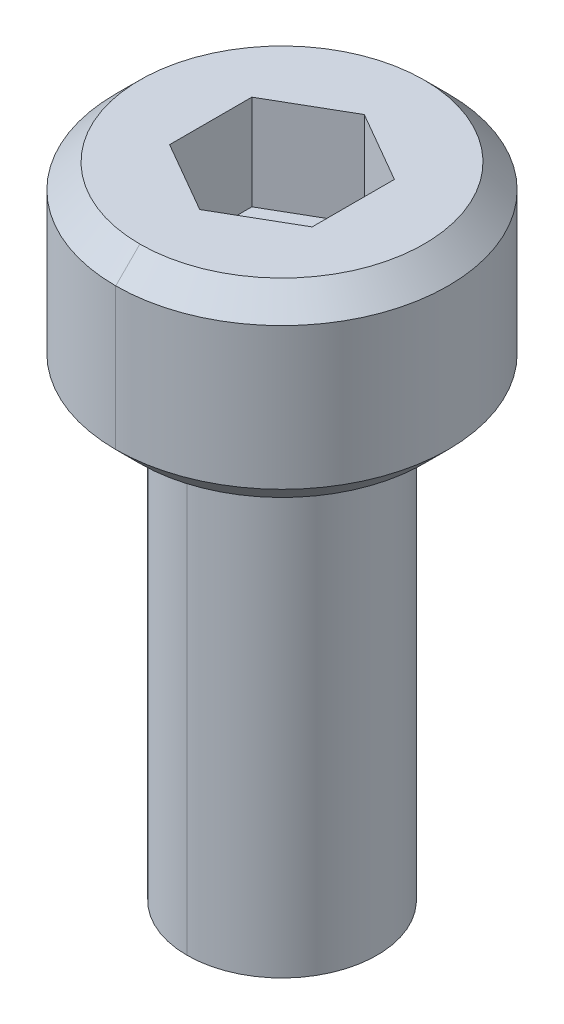
ISO-10303-21;
HEADER;
FILE_DESCRIPTION(('STEP AP214'),'2;1');
FILE_NAME('part.step','',(''),(''),'','','');
FILE_SCHEMA(('AUTOMOTIVE_DESIGN { 1 0 10303 214 1 1 1 1 }'));
ENDSEC;
DATA;
#1=APPLICATION_CONTEXT('core data for automotive mechanical design processes');
#2=APPLICATION_PROTOCOL_DEFINITION('international standard','automotive_design',2000,#1);
#3=PRODUCT_CONTEXT('',#1,'mechanical');
#4=PRODUCT('Part','Part','',(#3));
#5=PRODUCT_RELATED_PRODUCT_CATEGORY('part','',(#4));
#6=PRODUCT_DEFINITION_FORMATION('','',#4);
#7=PRODUCT_DEFINITION_CONTEXT('part definition',#1,'design');
#8=PRODUCT_DEFINITION('design','',#6,#7);
#9=PRODUCT_DEFINITION_SHAPE('','',#8);
#10=(LENGTH_UNIT() NAMED_UNIT(*) SI_UNIT(.MILLI.,.METRE.));
#11=(NAMED_UNIT(*) PLANE_ANGLE_UNIT() SI_UNIT($,.RADIAN.));
#12=(NAMED_UNIT(*) SI_UNIT($,.STERADIAN.) SOLID_ANGLE_UNIT());
#13=UNCERTAINTY_MEASURE_WITH_UNIT(LENGTH_MEASURE(1.E-05),#10,'distance_accuracy_value','');
#14=(GEOMETRIC_REPRESENTATION_CONTEXT(3) GLOBAL_UNCERTAINTY_ASSIGNED_CONTEXT((#13)) GLOBAL_UNIT_ASSIGNED_CONTEXT((#10,
#11,#12)) REPRESENTATION_CONTEXT('',''));
#15=CARTESIAN_POINT('',(0.,0.,0.));
#16=DIRECTION('',(0.,0.,1.));
#17=DIRECTION('',(1.,0.,0.));
#18=AXIS2_PLACEMENT_3D('',#15,#16,#17);
#19=CARTESIAN_POINT('',(0.,-9.46152,0.));
#20=DIRECTION('',(0.,1.,0.));
#21=DIRECTION('',(0.,0.,1.));
#22=AXIS2_PLACEMENT_3D('',#19,#20,#21);
#23=CONICAL_SURFACE('',#22,2.,0.960291895410487);
#24=DIRECTION('',(0.,0.573280843383964,-0.819358941251617));
#25=VECTOR('',#24,1.);
#26=CARTESIAN_POINT('',(0.,-9.46152,-2.));
#27=LINE('',#26,#25);
#28=CARTESIAN_POINT('',(0.,-10.,-1.23038));
#29=VERTEX_POINT('',#28);
#30=CARTESIAN_POINT('',(0.,-9.46152,-2.));
#31=VERTEX_POINT('',#30);
#32=EDGE_CURVE('E162',#29,#31,#27,.T.);
#33=ORIENTED_EDGE('',*,*,#32,.F.);
#34=CARTESIAN_POINT('',(0.,-10.,0.));
#35=DIRECTION('',(0.,-1.,0.));
#36=DIRECTION('',(0.,0.,1.));
#37=AXIS2_PLACEMENT_3D('',#34,#35,#36);
#38=CIRCLE('',#37,1.23038);
#39=CARTESIAN_POINT('',(0.,-10.,1.23037999999998));
#40=VERTEX_POINT('',#39);
#41=EDGE_CURVE('E151',#40,#29,#38,.T.);
#42=ORIENTED_EDGE('',*,*,#41,.F.);
#43=DIRECTION('',(0.,0.573280843383964,0.819358941251617));
#44=VECTOR('',#43,1.);
#45=CARTESIAN_POINT('',(0.,-9.46152,2.));
#46=LINE('',#45,#44);
#47=CARTESIAN_POINT('',(0.,-9.46152,2.));
#48=VERTEX_POINT('',#47);
#49=EDGE_CURVE('E159',#40,#48,#46,.T.);
#50=ORIENTED_EDGE('',*,*,#49,.T.);
#51=CARTESIAN_POINT('',(0.,-9.46152,0.));
#52=DIRECTION('',(0.,1.,0.));
#53=DIRECTION('',(0.,0.,1.));
#54=AXIS2_PLACEMENT_3D('',#51,#52,#53);
#55=CIRCLE('',#54,2.);
#56=EDGE_CURVE('E207',#31,#48,#55,.T.);
#57=ORIENTED_EDGE('',*,*,#56,.F.);
#58=EDGE_LOOP('',(#33,#42,#50,#57));
#59=FACE_BOUND('',#58,.T.);
#60=ADVANCED_FACE('F16',(#59),#23,.T.);
#61=CARTESIAN_POINT('',(0.,0.508,0.));
#62=DIRECTION('',(0.,1.,0.));
#63=DIRECTION('',(0.,0.,1.));
#64=AXIS2_PLACEMENT_3D('',#61,#62,#63);
#65=CONICAL_SURFACE('',#64,3.5,0.78539816339745);
#66=DIRECTION('',(0.,0.707106781186547,-0.707106781186549));
#67=VECTOR('',#66,1.);
#68=CARTESIAN_POINT('',(0.,0.508,-3.5));
#69=LINE('',#68,#67);
#70=CARTESIAN_POINT('',(0.,0.,-2.992));
#71=VERTEX_POINT('',#70);
#72=CARTESIAN_POINT('',(0.,0.508,-3.5));
#73=VERTEX_POINT('',#72);
#74=EDGE_CURVE('E264',#71,#73,#69,.T.);
#75=ORIENTED_EDGE('',*,*,#74,.F.);
#76=CARTESIAN_POINT('',(0.,0.,0.));
#77=DIRECTION('',(0.,-1.,0.));
#78=DIRECTION('',(0.,0.,1.));
#79=AXIS2_PLACEMENT_3D('',#76,#77,#78);
#80=CIRCLE('',#79,2.992);
#81=CARTESIAN_POINT('',(0.,0.,2.992));
#82=VERTEX_POINT('',#81);
#83=EDGE_CURVE('E211',#82,#71,#80,.T.);
#84=ORIENTED_EDGE('',*,*,#83,.F.);
#85=DIRECTION('',(0.,0.707106781186547,0.707106781186549));
#86=VECTOR('',#85,1.);
#87=CARTESIAN_POINT('',(0.,0.508,3.5));
#88=LINE('',#87,#86);
#89=CARTESIAN_POINT('',(0.,0.508,3.5));
#90=VERTEX_POINT('',#89);
#91=EDGE_CURVE('E229',#82,#90,#88,.T.);
#92=ORIENTED_EDGE('',*,*,#91,.T.);
#93=CARTESIAN_POINT('',(0.,0.508,0.));
#94=DIRECTION('',(0.,1.,0.));
#95=DIRECTION('',(0.,0.,1.));
#96=AXIS2_PLACEMENT_3D('',#93,#94,#95);
#97=CIRCLE('',#96,3.5);
#98=EDGE_CURVE('E140',#73,#90,#97,.T.);
#99=ORIENTED_EDGE('',*,*,#98,.F.);
#100=EDGE_LOOP('',(#75,#84,#92,#99));
#101=FACE_BOUND('',#100,.T.);
#102=ADVANCED_FACE('F320',(#101),#65,.T.);
#103=CARTESIAN_POINT('',(0.,3.999992,0.));
#104=DIRECTION('',(0.,-1.,0.));
#105=DIRECTION('',(0.,0.,-1.));
#106=AXIS2_PLACEMENT_3D('',#103,#104,#105);
#107=CONICAL_SURFACE('',#106,2.992,0.785398163397445);
#108=DIRECTION('',(0.,-0.70710678118655,0.707106781186545));
#109=VECTOR('',#108,1.);
#110=CARTESIAN_POINT('',(0.,3.999992,2.992));
#111=LINE('',#110,#109);
#112=CARTESIAN_POINT('',(0.,3.999992,2.992));
#113=VERTEX_POINT('',#112);
#114=CARTESIAN_POINT('',(0.,3.491992,3.5));
#115=VERTEX_POINT('',#114);
#116=EDGE_CURVE('E199',#113,#115,#111,.T.);
#117=ORIENTED_EDGE('',*,*,#116,.F.);
#118=CARTESIAN_POINT('',(0.,3.999992,0.));
#119=DIRECTION('',(0.,1.,0.));
#120=DIRECTION('',(0.,0.,1.));
#121=AXIS2_PLACEMENT_3D('',#118,#119,#120);
#122=CIRCLE('',#121,2.992);
#123=CARTESIAN_POINT('',(0.,3.999992,-2.992));
#124=VERTEX_POINT('',#123);
#125=EDGE_CURVE('E130',#124,#113,#122,.T.);
#126=ORIENTED_EDGE('',*,*,#125,.F.);
#127=DIRECTION('',(0.,-0.70710678118655,-0.707106781186545));
#128=VECTOR('',#127,1.);
#129=CARTESIAN_POINT('',(0.,3.999992,-2.992));
#130=LINE('',#129,#128);
#131=CARTESIAN_POINT('',(0.,3.491992,-3.5));
#132=VERTEX_POINT('',#131);
#133=EDGE_CURVE('E237',#124,#132,#130,.T.);
#134=ORIENTED_EDGE('',*,*,#133,.T.);
#135=CARTESIAN_POINT('',(0.,3.491992,0.));
#136=DIRECTION('',(0.,-1.,0.));
#137=DIRECTION('',(0.,0.,1.));
#138=AXIS2_PLACEMENT_3D('',#135,#136,#137);
#139=CIRCLE('',#138,3.5);
#140=EDGE_CURVE('E165',#115,#132,#139,.T.);
#141=ORIENTED_EDGE('',*,*,#140,.F.);
#142=EDGE_LOOP('',(#117,#126,#134,#141));
#143=FACE_BOUND('',#142,.T.);
#144=ADVANCED_FACE('F548',(#143),#107,.T.);
#145=CARTESIAN_POINT('',(1.5,1.999992,2.5980762113533));
#146=DIRECTION('',(0.,1.,0.));
#147=DIRECTION('',(0.,0.,-1.));
#148=AXIS2_PLACEMENT_3D('',#145,#146,#147);
#149=PLANE('',#148);
#150=DIRECTION('',(0.866025403784439,0.,0.5));
#151=VECTOR('',#150,1.);
#152=CARTESIAN_POINT('',(-1.5,1.999992,0.866025403784439));
#153=LINE('',#152,#151);
#154=CARTESIAN_POINT('',(-1.5,1.999992,0.866025403784439));
#155=VERTEX_POINT('',#154);
#156=CARTESIAN_POINT('',(0.,1.999992,1.73205080756887));
#157=VERTEX_POINT('',#156);
#158=EDGE_CURVE('E226',#155,#157,#153,.T.);
#159=ORIENTED_EDGE('',*,*,#158,.T.);
#160=DIRECTION('',(0.866025403784439,0.,-0.5));
#161=VECTOR('',#160,1.);
#162=CARTESIAN_POINT('',(0.,1.999992,1.73205080756887));
#163=LINE('',#162,#161);
#164=CARTESIAN_POINT('',(1.5,1.999992,0.866025403784439));
#165=VERTEX_POINT('',#164);
#166=EDGE_CURVE('E11',#157,#165,#163,.T.);
#167=ORIENTED_EDGE('',*,*,#166,.T.);
#168=DIRECTION('',(0.,0.,-1.));
#169=VECTOR('',#168,1.);
#170=CARTESIAN_POINT('',(1.5,1.999992,0.866025403784439));
#171=LINE('',#170,#169);
#172=CARTESIAN_POINT('',(1.5,1.99999200000004,-0.866025403784422));
#173=VERTEX_POINT('',#172);
#174=EDGE_CURVE('E195',#165,#173,#171,.T.);
#175=ORIENTED_EDGE('',*,*,#174,.T.);
#176=DIRECTION('',(-0.866025403784439,0.,-0.5));
#177=VECTOR('',#176,1.);
#178=CARTESIAN_POINT('',(1.5,1.99999200000004,-0.866025403784422));
#179=LINE('',#178,#177);
#180=CARTESIAN_POINT('',(0.,1.999992,-1.73205080756887));
#181=VERTEX_POINT('',#180);
#182=EDGE_CURVE('E221',#173,#181,#179,.T.);
#183=ORIENTED_EDGE('',*,*,#182,.T.);
#184=DIRECTION('',(-0.866025403784439,0.,0.5));
#185=VECTOR('',#184,1.);
#186=CARTESIAN_POINT('',(0.,1.999992,-1.73205080756887));
#187=LINE('',#186,#185);
#188=CARTESIAN_POINT('',(-1.5,1.999992,-0.866025403784432));
#189=VERTEX_POINT('',#188);
#190=EDGE_CURVE('E184',#181,#189,#187,.T.);
#191=ORIENTED_EDGE('',*,*,#190,.T.);
#192=DIRECTION('',(0.,0.,1.));
#193=VECTOR('',#192,1.);
#194=CARTESIAN_POINT('',(-1.5,1.999992,-0.866025403784432));
#195=LINE('',#194,#193);
#196=EDGE_CURVE('E257',#189,#155,#195,.T.);
#197=ORIENTED_EDGE('',*,*,#196,.T.);
#198=EDGE_LOOP('',(#159,#167,#175,#183,#191,#197));
#199=FACE_BOUND('',#198,.T.);
#200=ADVANCED_FACE('F543',(#199),#149,.T.);
#201=CARTESIAN_POINT('',(0.,1.999992,1.73205080756887));
#202=DIRECTION('',(0.5,0.,0.866025403784439));
#203=DIRECTION('',(0.,-1.,0.));
#204=AXIS2_PLACEMENT_3D('',#201,#202,#203);
#205=PLANE('',#204);
#206=DIRECTION('',(0.866025403784439,0.,-0.5));
#207=VECTOR('',#206,1.);
#208=CARTESIAN_POINT('',(0.,3.999992,1.73205080756889));
#209=LINE('',#208,#207);
#210=CARTESIAN_POINT('',(0.,3.999992,1.73205080756889));
#211=VERTEX_POINT('',#210);
#212=CARTESIAN_POINT('',(1.5,3.999992,0.866025403784439));
#213=VERTEX_POINT('',#212);
#214=EDGE_CURVE('E215',#211,#213,#209,.T.);
#215=ORIENTED_EDGE('',*,*,#214,.T.);
#216=DIRECTION('',(0.,1.,0.));
#217=VECTOR('',#216,1.);
#218=CARTESIAN_POINT('',(1.5,1.999992,0.866025403784439));
#219=LINE('',#218,#217);
#220=EDGE_CURVE('E27',#165,#213,#219,.T.);
#221=ORIENTED_EDGE('',*,*,#220,.F.);
#222=ORIENTED_EDGE('',*,*,#166,.F.);
#223=DIRECTION('',(0.,1.,0.));
#224=VECTOR('',#223,1.);
#225=CARTESIAN_POINT('',(0.,1.999992,1.73205080756887));
#226=LINE('',#225,#224);
#227=EDGE_CURVE('E214',#157,#211,#226,.T.);
#228=ORIENTED_EDGE('',*,*,#227,.T.);
#229=EDGE_LOOP('',(#215,#221,#222,#228));
#230=FACE_BOUND('',#229,.T.);
#231=ADVANCED_FACE('F547',(#230),#205,.F.);
#232=CARTESIAN_POINT('',(1.5,1.999992,0.866025403784439));
#233=DIRECTION('',(1.,0.,0.));
#234=DIRECTION('',(0.,-1.,0.));
#235=AXIS2_PLACEMENT_3D('',#232,#233,#234);
#236=PLANE('',#235);
#237=DIRECTION('',(0.,0.,-1.));
#238=VECTOR('',#237,1.);
#239=CARTESIAN_POINT('',(1.5,3.999992,0.866025403784439));
#240=LINE('',#239,#238);
#241=CARTESIAN_POINT('',(1.5,3.999992,-0.866025403784429));
#242=VERTEX_POINT('',#241);
#243=EDGE_CURVE('E216',#213,#242,#240,.T.);
#244=ORIENTED_EDGE('',*,*,#243,.T.);
#245=DIRECTION('',(0.,1.,0.));
#246=VECTOR('',#245,1.);
#247=CARTESIAN_POINT('',(1.5,1.99999200000004,-0.866025403784422));
#248=LINE('',#247,#246);
#249=EDGE_CURVE('E198',#173,#242,#248,.T.);
#250=ORIENTED_EDGE('',*,*,#249,.F.);
#251=ORIENTED_EDGE('',*,*,#174,.F.);
#252=ORIENTED_EDGE('',*,*,#220,.T.);
#253=EDGE_LOOP('',(#244,#250,#251,#252));
#254=FACE_BOUND('',#253,.T.);
#255=ADVANCED_FACE('F572',(#254),#236,.F.);
#256=CARTESIAN_POINT('',(1.5,1.99999200000004,-0.866025403784422));
#257=DIRECTION('',(0.5,0.,-0.866025403784439));
#258=DIRECTION('',(0.,-1.,0.));
#259=AXIS2_PLACEMENT_3D('',#256,#257,#258);
#260=PLANE('',#259);
#261=DIRECTION('',(-0.866025403784439,0.,-0.5));
#262=VECTOR('',#261,1.);
#263=CARTESIAN_POINT('',(1.5,3.999992,-0.866025403784429));
#264=LINE('',#263,#262);
#265=CARTESIAN_POINT('',(0.,3.99999200000005,-1.73205080756887));
#266=VERTEX_POINT('',#265);
#267=EDGE_CURVE('E220',#242,#266,#264,.T.);
#268=ORIENTED_EDGE('',*,*,#267,.T.);
#269=DIRECTION('',(0.,1.,0.));
#270=VECTOR('',#269,1.);
#271=CARTESIAN_POINT('',(0.,1.999992,-1.73205080756887));
#272=LINE('',#271,#270);
#273=EDGE_CURVE('E187',#181,#266,#272,.T.);
#274=ORIENTED_EDGE('',*,*,#273,.F.);
#275=ORIENTED_EDGE('',*,*,#182,.F.);
#276=ORIENTED_EDGE('',*,*,#249,.T.);
#277=EDGE_LOOP('',(#268,#274,#275,#276));
#278=FACE_BOUND('',#277,.T.);
#279=ADVANCED_FACE('F616',(#278),#260,.F.);
#280=CARTESIAN_POINT('',(0.,1.999992,-1.73205080756887));
#281=DIRECTION('',(-0.5,0.,-0.866025403784439));
#282=DIRECTION('',(-0.866025403784439,0.,0.5));
#283=AXIS2_PLACEMENT_3D('',#280,#281,#282);
#284=PLANE('',#283);
#285=DIRECTION('',(-0.866025403784439,0.,0.5));
#286=VECTOR('',#285,1.);
#287=CARTESIAN_POINT('',(0.,3.99999200000005,-1.73205080756887));
#288=LINE('',#287,#286);
#289=CARTESIAN_POINT('',(-1.5,3.999992,-0.866025403784432));
#290=VERTEX_POINT('',#289);
#291=EDGE_CURVE('E193',#266,#290,#288,.T.);
#292=ORIENTED_EDGE('',*,*,#291,.T.);
#293=DIRECTION('',(0.,1.,0.));
#294=VECTOR('',#293,1.);
#295=CARTESIAN_POINT('',(-1.5,1.999992,-0.866025403784432));
#296=LINE('',#295,#294);
#297=EDGE_CURVE('E188',#189,#290,#296,.T.);
#298=ORIENTED_EDGE('',*,*,#297,.F.);
#299=ORIENTED_EDGE('',*,*,#190,.F.);
#300=ORIENTED_EDGE('',*,*,#273,.T.);
#301=EDGE_LOOP('',(#292,#298,#299,#300));
#302=FACE_BOUND('',#301,.T.);
#303=ADVANCED_FACE('F18',(#302),#284,.F.);
#304=CARTESIAN_POINT('',(-1.5,1.999992,-0.866025403784432));
#305=DIRECTION('',(-1.,0.,0.));
#306=DIRECTION('',(0.,0.,1.));
#307=AXIS2_PLACEMENT_3D('',#304,#305,#306);
#308=PLANE('',#307);
#309=DIRECTION('',(0.,0.,1.));
#310=VECTOR('',#309,1.);
#311=CARTESIAN_POINT('',(-1.5,3.999992,-0.866025403784432));
#312=LINE('',#311,#310);
#313=CARTESIAN_POINT('',(-1.5,3.999992,0.866025403784453));
#314=VERTEX_POINT('',#313);
#315=EDGE_CURVE('E189',#290,#314,#312,.T.);
#316=ORIENTED_EDGE('',*,*,#315,.T.);
#317=DIRECTION('',(0.,1.,0.));
#318=VECTOR('',#317,1.);
#319=CARTESIAN_POINT('',(-1.5,1.999992,0.866025403784439));
#320=LINE('',#319,#318);
#321=EDGE_CURVE('E260',#155,#314,#320,.T.);
#322=ORIENTED_EDGE('',*,*,#321,.F.);
#323=ORIENTED_EDGE('',*,*,#196,.F.);
#324=ORIENTED_EDGE('',*,*,#297,.T.);
#325=EDGE_LOOP('',(#316,#322,#323,#324));
#326=FACE_BOUND('',#325,.T.);
#327=ADVANCED_FACE('F581',(#326),#308,.F.);
#328=CARTESIAN_POINT('',(-1.5,1.999992,0.866025403784439));
#329=DIRECTION('',(-0.5,0.,0.866025403784439));
#330=DIRECTION('',(0.,1.,0.));
#331=AXIS2_PLACEMENT_3D('',#328,#329,#330);
#332=PLANE('',#331);
#333=DIRECTION('',(0.866025403784439,0.,0.5));
#334=VECTOR('',#333,1.);
#335=CARTESIAN_POINT('',(-1.5,3.999992,0.866025403784453));
#336=LINE('',#335,#334);
#337=EDGE_CURVE('E194',#314,#211,#336,.T.);
#338=ORIENTED_EDGE('',*,*,#337,.T.);
#339=ORIENTED_EDGE('',*,*,#227,.F.);
#340=ORIENTED_EDGE('',*,*,#158,.F.);
#341=ORIENTED_EDGE('',*,*,#321,.T.);
#342=EDGE_LOOP('',(#338,#339,#340,#341));
#343=FACE_BOUND('',#342,.T.);
#344=ADVANCED_FACE('F314',(#343),#332,.F.);
#345=CARTESIAN_POINT('',(0.,0.,0.));
#346=DIRECTION('',(0.,1.,0.));
#347=DIRECTION('',(0.,0.,-1.));
#348=AXIS2_PLACEMENT_3D('',#345,#346,#347);
#349=PLANE('',#348);
#350=CARTESIAN_POINT('',(0.,0.,0.));
#351=DIRECTION('',(0.,1.,0.));
#352=DIRECTION('',(0.,0.,1.));
#353=AXIS2_PLACEMENT_3D('',#350,#351,#352);
#354=CIRCLE('',#353,2.);
#355=CARTESIAN_POINT('',(0.,0.,2.));
#356=VERTEX_POINT('',#355);
#357=CARTESIAN_POINT('',(0.,0.,-2.));
#358=VERTEX_POINT('',#357);
#359=EDGE_CURVE('E238',#356,#358,#354,.T.);
#360=ORIENTED_EDGE('',*,*,#359,.T.);
#361=CARTESIAN_POINT('',(0.,0.,0.));
#362=DIRECTION('',(0.,1.,0.));
#363=DIRECTION('',(0.,0.,1.));
#364=AXIS2_PLACEMENT_3D('',#361,#362,#363);
#365=CIRCLE('',#364,2.);
#366=EDGE_CURVE('E166',#358,#356,#365,.T.);
#367=ORIENTED_EDGE('',*,*,#366,.T.);
#368=EDGE_LOOP('',(#360,#367));
#369=FACE_BOUND('',#368,.T.);
#370=ORIENTED_EDGE('',*,*,#83,.T.);
#371=CARTESIAN_POINT('',(0.,0.,0.));
#372=DIRECTION('',(0.,-1.,0.));
#373=DIRECTION('',(0.,0.,1.));
#374=AXIS2_PLACEMENT_3D('',#371,#372,#373);
#375=CIRCLE('',#374,2.992);
#376=EDGE_CURVE('E174',#71,#82,#375,.T.);
#377=ORIENTED_EDGE('',*,*,#376,.T.);
#378=EDGE_LOOP('',(#370,#377));
#379=FACE_BOUND('',#378,.T.);
#380=ADVANCED_FACE('F310',(#369,#379),#349,.F.);
#381=CARTESIAN_POINT('',(0.,3.999992,0.));
#382=DIRECTION('',(0.,1.,0.));
#383=DIRECTION('',(0.,0.,-1.));
#384=AXIS2_PLACEMENT_3D('',#381,#382,#383);
#385=PLANE('',#384);
#386=ORIENTED_EDGE('',*,*,#337,.F.);
#387=ORIENTED_EDGE('',*,*,#315,.F.);
#388=ORIENTED_EDGE('',*,*,#291,.F.);
#389=ORIENTED_EDGE('',*,*,#267,.F.);
#390=ORIENTED_EDGE('',*,*,#243,.F.);
#391=ORIENTED_EDGE('',*,*,#214,.F.);
#392=EDGE_LOOP('',(#386,#387,#388,#389,#390,#391));
#393=FACE_BOUND('',#392,.T.);
#394=ORIENTED_EDGE('',*,*,#125,.T.);
#395=CARTESIAN_POINT('',(0.,3.999992,0.));
#396=DIRECTION('',(0.,1.,0.));
#397=DIRECTION('',(0.,0.,1.));
#398=AXIS2_PLACEMENT_3D('',#395,#396,#397);
#399=CIRCLE('',#398,2.992);
#400=EDGE_CURVE('E204',#113,#124,#399,.T.);
#401=ORIENTED_EDGE('',*,*,#400,.T.);
#402=EDGE_LOOP('',(#394,#401));
#403=FACE_BOUND('',#402,.T.);
#404=ADVANCED_FACE('F313',(#393,#403),#385,.T.);
#405=CARTESIAN_POINT('',(0.,3.999992,0.));
#406=DIRECTION('',(0.,-1.,0.));
#407=DIRECTION('',(0.,0.,-1.));
#408=AXIS2_PLACEMENT_3D('',#405,#406,#407);
#409=CYLINDRICAL_SURFACE('',#408,3.5);
#410=DIRECTION('',(0.,-1.,0.));
#411=VECTOR('',#410,1.);
#412=CARTESIAN_POINT('',(0.,3.999992,3.5));
#413=LINE('',#412,#411);
#414=EDGE_CURVE('E233',#115,#90,#413,.T.);
#415=ORIENTED_EDGE('',*,*,#414,.F.);
#416=ORIENTED_EDGE('',*,*,#140,.T.);
#417=DIRECTION('',(0.,-1.,0.));
#418=VECTOR('',#417,1.);
#419=CARTESIAN_POINT('',(0.,3.999992,-3.5));
#420=LINE('',#419,#418);
#421=EDGE_CURVE('E236',#132,#73,#420,.T.);
#422=ORIENTED_EDGE('',*,*,#421,.T.);
#423=ORIENTED_EDGE('',*,*,#98,.T.);
#424=EDGE_LOOP('',(#415,#416,#422,#423));
#425=FACE_BOUND('',#424,.T.);
#426=ADVANCED_FACE('F564',(#425),#409,.T.);
#427=CARTESIAN_POINT('',(0.,-10.,0.));
#428=DIRECTION('',(0.,1.,0.));
#429=DIRECTION('',(0.,0.,-1.));
#430=AXIS2_PLACEMENT_3D('',#427,#428,#429);
#431=PLANE('',#430);
#432=ORIENTED_EDGE('',*,*,#41,.T.);
#433=CARTESIAN_POINT('',(0.,-10.,0.));
#434=DIRECTION('',(0.,-1.,0.));
#435=DIRECTION('',(0.,0.,1.));
#436=AXIS2_PLACEMENT_3D('',#433,#434,#435);
#437=CIRCLE('',#436,1.23038);
#438=EDGE_CURVE('E170',#29,#40,#437,.T.);
#439=ORIENTED_EDGE('',*,*,#438,.T.);
#440=EDGE_LOOP('',(#432,#439));
#441=FACE_BOUND('',#440,.T.);
#442=ADVANCED_FACE('F176',(#441),#431,.F.);
#443=CARTESIAN_POINT('',(0.,-10.,0.));
#444=DIRECTION('',(0.,1.,0.));
#445=DIRECTION('',(0.,0.,1.));
#446=AXIS2_PLACEMENT_3D('',#443,#444,#445);
#447=CYLINDRICAL_SURFACE('',#446,2.);
#448=DIRECTION('',(0.,1.,0.));
#449=VECTOR('',#448,1.);
#450=CARTESIAN_POINT('',(0.,-10.,-2.));
#451=LINE('',#450,#449);
#452=EDGE_CURVE('E242',#31,#358,#451,.T.);
#453=ORIENTED_EDGE('',*,*,#452,.F.);
#454=ORIENTED_EDGE('',*,*,#56,.T.);
#455=DIRECTION('',(0.,1.,0.));
#456=VECTOR('',#455,1.);
#457=CARTESIAN_POINT('',(0.,-10.,2.));
#458=LINE('',#457,#456);
#459=EDGE_CURVE('E210',#48,#356,#458,.T.);
#460=ORIENTED_EDGE('',*,*,#459,.T.);
#461=ORIENTED_EDGE('',*,*,#366,.F.);
#462=EDGE_LOOP('',(#453,#454,#460,#461));
#463=FACE_BOUND('',#462,.T.);
#464=ADVANCED_FACE('F308',(#463),#447,.T.);
#465=CARTESIAN_POINT('',(0.,-10.,0.));
#466=DIRECTION('',(0.,1.,0.));
#467=DIRECTION('',(0.,0.,1.));
#468=AXIS2_PLACEMENT_3D('',#465,#466,#467);
#469=CYLINDRICAL_SURFACE('',#468,2.);
#470=CARTESIAN_POINT('',(0.,-9.46152,0.));
#471=DIRECTION('',(0.,1.,0.));
#472=DIRECTION('',(0.,0.,1.));
#473=AXIS2_PLACEMENT_3D('',#470,#471,#472);
#474=CIRCLE('',#473,2.);
#475=EDGE_CURVE('E172',#48,#31,#474,.T.);
#476=ORIENTED_EDGE('',*,*,#475,.T.);
#477=ORIENTED_EDGE('',*,*,#452,.T.);
#478=ORIENTED_EDGE('',*,*,#359,.F.);
#479=ORIENTED_EDGE('',*,*,#459,.F.);
#480=EDGE_LOOP('',(#476,#477,#478,#479));
#481=FACE_BOUND('',#480,.T.);
#482=ADVANCED_FACE('F305',(#481),#469,.T.);
#483=CARTESIAN_POINT('',(0.,3.999992,0.));
#484=DIRECTION('',(0.,-1.,0.));
#485=DIRECTION('',(0.,0.,-1.));
#486=AXIS2_PLACEMENT_3D('',#483,#484,#485);
#487=CYLINDRICAL_SURFACE('',#486,3.5);
#488=CARTESIAN_POINT('',(0.,3.491992,0.));
#489=DIRECTION('',(0.,-1.,0.));
#490=DIRECTION('',(0.,0.,1.));
#491=AXIS2_PLACEMENT_3D('',#488,#489,#490);
#492=CIRCLE('',#491,3.5);
#493=EDGE_CURVE('E203',#132,#115,#492,.T.);
#494=ORIENTED_EDGE('',*,*,#493,.T.);
#495=ORIENTED_EDGE('',*,*,#414,.T.);
#496=CARTESIAN_POINT('',(0.,0.508,0.));
#497=DIRECTION('',(0.,1.,0.));
#498=DIRECTION('',(0.,0.,1.));
#499=AXIS2_PLACEMENT_3D('',#496,#497,#498);
#500=CIRCLE('',#499,3.5);
#501=EDGE_CURVE('E20',#90,#73,#500,.T.);
#502=ORIENTED_EDGE('',*,*,#501,.T.);
#503=ORIENTED_EDGE('',*,*,#421,.F.);
#504=EDGE_LOOP('',(#494,#495,#502,#503));
#505=FACE_BOUND('',#504,.T.);
#506=ADVANCED_FACE('F587',(#505),#487,.T.);
#507=CARTESIAN_POINT('',(0.,3.999992,0.));
#508=DIRECTION('',(0.,-1.,0.));
#509=DIRECTION('',(0.,0.,-1.));
#510=AXIS2_PLACEMENT_3D('',#507,#508,#509);
#511=CONICAL_SURFACE('',#510,2.992,0.785398163397445);
#512=ORIENTED_EDGE('',*,*,#400,.F.);
#513=ORIENTED_EDGE('',*,*,#116,.T.);
#514=ORIENTED_EDGE('',*,*,#493,.F.);
#515=ORIENTED_EDGE('',*,*,#133,.F.);
#516=EDGE_LOOP('',(#512,#513,#514,#515));
#517=FACE_BOUND('',#516,.T.);
#518=ADVANCED_FACE('F591',(#517),#511,.T.);
#519=CARTESIAN_POINT('',(0.,0.508,0.));
#520=DIRECTION('',(0.,1.,0.));
#521=DIRECTION('',(0.,0.,1.));
#522=AXIS2_PLACEMENT_3D('',#519,#520,#521);
#523=CONICAL_SURFACE('',#522,3.5,0.78539816339745);
#524=ORIENTED_EDGE('',*,*,#376,.F.);
#525=ORIENTED_EDGE('',*,*,#74,.T.);
#526=ORIENTED_EDGE('',*,*,#501,.F.);
#527=ORIENTED_EDGE('',*,*,#91,.F.);
#528=EDGE_LOOP('',(#524,#525,#526,#527));
#529=FACE_BOUND('',#528,.T.);
#530=ADVANCED_FACE('F323',(#529),#523,.T.);
#531=CARTESIAN_POINT('',(0.,-9.46152,0.));
#532=DIRECTION('',(0.,1.,0.));
#533=DIRECTION('',(0.,0.,1.));
#534=AXIS2_PLACEMENT_3D('',#531,#532,#533);
#535=CONICAL_SURFACE('',#534,2.,0.960291895410487);
#536=ORIENTED_EDGE('',*,*,#438,.F.);
#537=ORIENTED_EDGE('',*,*,#32,.T.);
#538=ORIENTED_EDGE('',*,*,#475,.F.);
#539=ORIENTED_EDGE('',*,*,#49,.F.);
#540=EDGE_LOOP('',(#536,#537,#538,#539));
#541=FACE_BOUND('',#540,.T.);
#542=ADVANCED_FACE('F169',(#541),#535,.T.);
#543=CLOSED_SHELL('',(#60,#102,#144,#200,#231,#255,#279,#303,#327,#344,#380,#404,#426,#442,#464,
#482,#506,#518,#530,#542));
#544=MANIFOLD_SOLID_BREP('B1',#543);
#545=ADVANCED_BREP_SHAPE_REPRESENTATION('',(#18,#544),#14);
#546=SHAPE_DEFINITION_REPRESENTATION(#9,#545);
ENDSEC;
END-ISO-10303-21;
